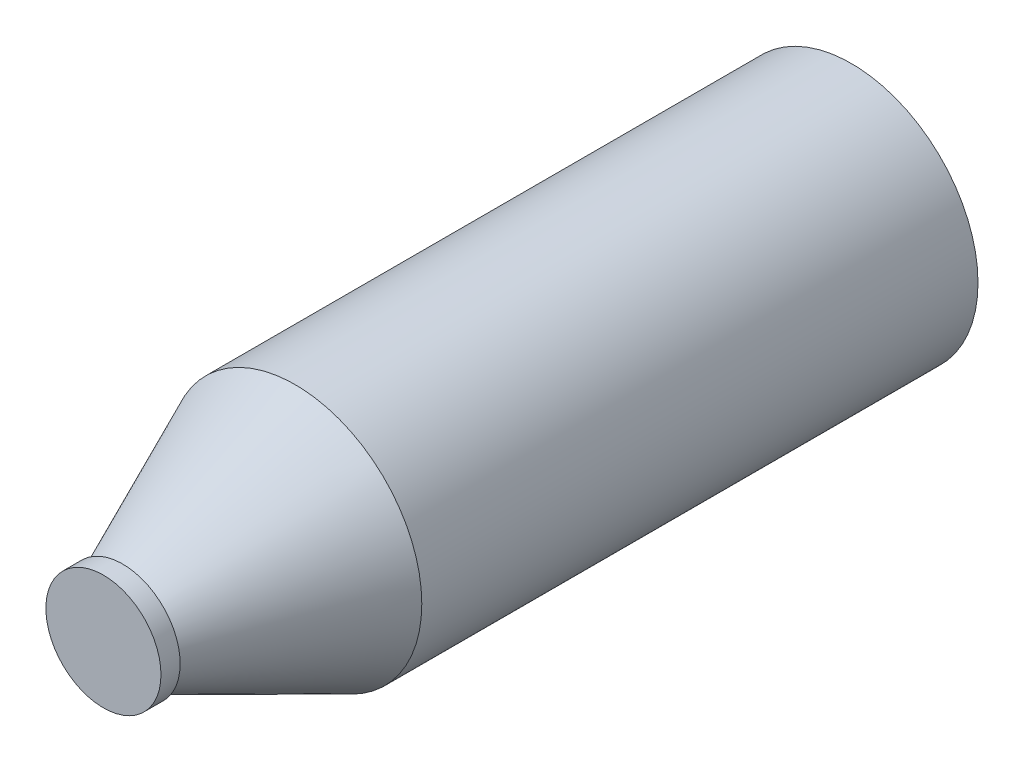
ISO-10303-21;
HEADER;
FILE_DESCRIPTION(('STEP AP214'),'2;1');
FILE_NAME('part.step','',(''),(''),'','','');
FILE_SCHEMA(('AUTOMOTIVE_DESIGN { 1 0 10303 214 1 1 1 1 }'));
ENDSEC;
DATA;
#1=APPLICATION_CONTEXT('core data for automotive mechanical design processes');
#2=APPLICATION_PROTOCOL_DEFINITION('international standard','automotive_design',2000,#1);
#3=PRODUCT_CONTEXT('',#1,'mechanical');
#4=PRODUCT('Part','Part','',(#3));
#5=PRODUCT_RELATED_PRODUCT_CATEGORY('part','',(#4));
#6=PRODUCT_DEFINITION_FORMATION('','',#4);
#7=PRODUCT_DEFINITION_CONTEXT('part definition',#1,'design');
#8=PRODUCT_DEFINITION('design','',#6,#7);
#9=PRODUCT_DEFINITION_SHAPE('','',#8);
#10=(LENGTH_UNIT() NAMED_UNIT(*) SI_UNIT(.MILLI.,.METRE.));
#11=(NAMED_UNIT(*) PLANE_ANGLE_UNIT() SI_UNIT($,.RADIAN.));
#12=(NAMED_UNIT(*) SI_UNIT($,.STERADIAN.) SOLID_ANGLE_UNIT());
#13=UNCERTAINTY_MEASURE_WITH_UNIT(LENGTH_MEASURE(1.E-05),#10,'distance_accuracy_value','');
#14=(GEOMETRIC_REPRESENTATION_CONTEXT(3) GLOBAL_UNCERTAINTY_ASSIGNED_CONTEXT((#13)) GLOBAL_UNIT_ASSIGNED_CONTEXT((#10,
#11,#12)) REPRESENTATION_CONTEXT('',''));
#15=CARTESIAN_POINT('',(0.,0.,0.));
#16=DIRECTION('',(0.,0.,1.));
#17=DIRECTION('',(1.,0.,0.));
#18=AXIS2_PLACEMENT_3D('',#15,#16,#17);
#19=CARTESIAN_POINT('',(41.0507095042593,36.4787893596962,145.));
#20=DIRECTION('',(0.,0.,-1.));
#21=DIRECTION('',(-1.,0.,0.));
#22=AXIS2_PLACEMENT_3D('',#19,#20,#21);
#23=CYLINDRICAL_SURFACE('',#22,33.);
#24=CARTESIAN_POINT('',(41.0507095042593,36.4787893596962,145.));
#25=DIRECTION('',(0.,0.,1.));
#26=DIRECTION('',(1.,0.,0.));
#27=AXIS2_PLACEMENT_3D('',#24,#25,#26);
#28=CIRCLE('',#27,33.);
#29=CARTESIAN_POINT('',(74.0507095042593,36.4787893596962,145.));
#30=VERTEX_POINT('',#29);
#31=EDGE_CURVE('E10',#30,#30,#28,.T.);
#32=ORIENTED_EDGE('',*,*,#31,.F.);
#33=EDGE_LOOP('',(#32));
#34=FACE_BOUND('',#33,.T.);
#35=CARTESIAN_POINT('',(41.0507095042593,36.4787893596962,0.));
#36=DIRECTION('',(0.,0.,1.));
#37=DIRECTION('',(1.,0.,0.));
#38=AXIS2_PLACEMENT_3D('',#35,#36,#37);
#39=CIRCLE('',#38,33.);
#40=CARTESIAN_POINT('',(74.0507095042593,36.4787893596962,0.));
#41=VERTEX_POINT('',#40);
#42=EDGE_CURVE('E34',#41,#41,#39,.T.);
#43=ORIENTED_EDGE('',*,*,#42,.T.);
#44=EDGE_LOOP('',(#43));
#45=FACE_BOUND('',#44,.T.);
#46=ADVANCED_FACE('F31',(#34,#45),#23,.T.);
#47=CARTESIAN_POINT('',(41.0507095042593,36.4787893596962,0.));
#48=DIRECTION('',(0.,0.,1.));
#49=DIRECTION('',(1.,0.,0.));
#50=AXIS2_PLACEMENT_3D('',#47,#48,#49);
#51=PLANE('',#50);
#52=ORIENTED_EDGE('',*,*,#42,.F.);
#53=EDGE_LOOP('',(#52));
#54=FACE_BOUND('',#53,.T.);
#55=ADVANCED_FACE('F68',(#54),#51,.F.);
#56=CARTESIAN_POINT('',(41.0507095042592,36.4787893596961,145.));
#57=DIRECTION('',(0.,0.,-1.));
#58=DIRECTION('',(1.,0.,0.));
#59=AXIS2_PLACEMENT_3D('',#56,#57,#58);
#60=CONICAL_SURFACE('',#59,32.9999999999999,0.41887902047864);
#61=CARTESIAN_POINT('',(41.0507095042592,36.4787893596961,190.));
#62=DIRECTION('',(0.,0.,1.));
#63=DIRECTION('',(1.,0.,0.));
#64=AXIS2_PLACEMENT_3D('',#61,#62,#63);
#65=CIRCLE('',#64,12.9647091611157);
#66=CARTESIAN_POINT('',(54.0154186653749,36.4787893596961,190.));
#67=VERTEX_POINT('',#66);
#68=EDGE_CURVE('E41',#67,#67,#65,.T.);
#69=ORIENTED_EDGE('',*,*,#68,.F.);
#70=EDGE_LOOP('',(#69));
#71=FACE_BOUND('',#70,.T.);
#72=ORIENTED_EDGE('',*,*,#31,.T.);
#73=EDGE_LOOP('',(#72));
#74=FACE_BOUND('',#73,.T.);
#75=ADVANCED_FACE('F63',(#71,#74),#60,.T.);
#76=CARTESIAN_POINT('',(41.0507095042592,36.4787893596961,190.));
#77=DIRECTION('',(0.,0.,1.));
#78=DIRECTION('',(1.,0.,0.));
#79=AXIS2_PLACEMENT_3D('',#76,#77,#78);
#80=PLANE('',#79);
#81=CARTESIAN_POINT('',(41.0507095042592,36.4787893596961,190.));
#82=DIRECTION('',(0.,0.,1.));
#83=DIRECTION('',(1.,0.,0.));
#84=AXIS2_PLACEMENT_3D('',#81,#82,#83);
#85=CIRCLE('',#84,15.);
#86=CARTESIAN_POINT('',(56.0507095042592,36.4787893596961,190.));
#87=VERTEX_POINT('',#86);
#88=EDGE_CURVE('E46',#87,#87,#85,.T.);
#89=ORIENTED_EDGE('',*,*,#88,.F.);
#90=EDGE_LOOP('',(#89));
#91=FACE_BOUND('',#90,.T.);
#92=ORIENTED_EDGE('',*,*,#68,.T.);
#93=EDGE_LOOP('',(#92));
#94=FACE_BOUND('',#93,.T.);
#95=ADVANCED_FACE('F57',(#91,#94),#80,.F.);
#96=CARTESIAN_POINT('',(41.0507095042592,36.4787893596961,195.));
#97=DIRECTION('',(0.,0.,-1.));
#98=DIRECTION('',(-1.,0.,0.));
#99=AXIS2_PLACEMENT_3D('',#96,#97,#98);
#100=CYLINDRICAL_SURFACE('',#99,15.);
#101=CARTESIAN_POINT('',(41.0507095042592,36.4787893596961,195.));
#102=DIRECTION('',(0.,0.,1.));
#103=DIRECTION('',(1.,0.,0.));
#104=AXIS2_PLACEMENT_3D('',#101,#102,#103);
#105=CIRCLE('',#104,15.);
#106=CARTESIAN_POINT('',(56.0507095042592,36.4787893596961,195.));
#107=VERTEX_POINT('',#106);
#108=EDGE_CURVE('E45',#107,#107,#105,.T.);
#109=ORIENTED_EDGE('',*,*,#108,.F.);
#110=EDGE_LOOP('',(#109));
#111=FACE_BOUND('',#110,.T.);
#112=ORIENTED_EDGE('',*,*,#88,.T.);
#113=EDGE_LOOP('',(#112));
#114=FACE_BOUND('',#113,.T.);
#115=ADVANCED_FACE('F54',(#111,#114),#100,.T.);
#116=CARTESIAN_POINT('',(41.0507095042592,36.4787893596961,195.));
#117=DIRECTION('',(0.,0.,1.));
#118=DIRECTION('',(1.,0.,0.));
#119=AXIS2_PLACEMENT_3D('',#116,#117,#118);
#120=PLANE('',#119);
#121=ORIENTED_EDGE('',*,*,#108,.T.);
#122=EDGE_LOOP('',(#121));
#123=FACE_BOUND('',#122,.T.);
#124=ADVANCED_FACE('F52',(#123),#120,.T.);
#125=CLOSED_SHELL('',(#46,#55,#75,#95,#115,#124));
#126=MANIFOLD_SOLID_BREP('B2',#125);
#127=ADVANCED_BREP_SHAPE_REPRESENTATION('',(#18,#126),#14);
#128=SHAPE_DEFINITION_REPRESENTATION(#9,#127);
ENDSEC;
END-ISO-10303-21;
